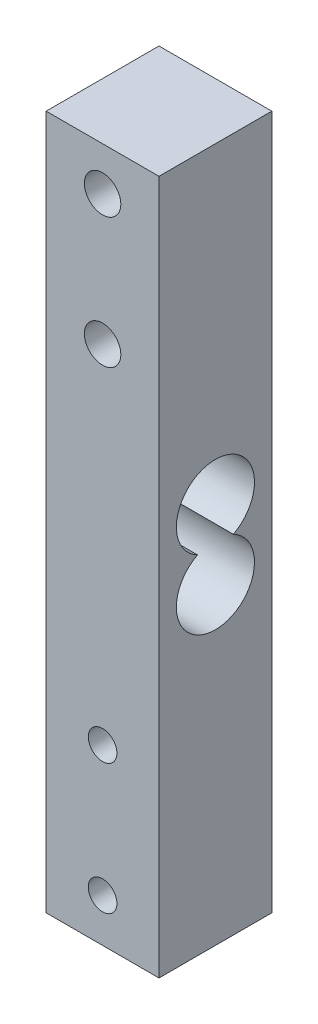
ISO-10303-21;
HEADER;
FILE_DESCRIPTION(('STEP AP214'),'2;1');
FILE_NAME('part.step','',(''),(''),'','','');
FILE_SCHEMA(('AUTOMOTIVE_DESIGN { 1 0 10303 214 1 1 1 1 }'));
ENDSEC;
DATA;
#1=APPLICATION_CONTEXT('core data for automotive mechanical design processes');
#2=APPLICATION_PROTOCOL_DEFINITION('international standard','automotive_design',2000,#1);
#3=PRODUCT_CONTEXT('',#1,'mechanical');
#4=PRODUCT('Part','Part','',(#3));
#5=PRODUCT_RELATED_PRODUCT_CATEGORY('part','',(#4));
#6=PRODUCT_DEFINITION_FORMATION('','',#4);
#7=PRODUCT_DEFINITION_CONTEXT('part definition',#1,'design');
#8=PRODUCT_DEFINITION('design','',#6,#7);
#9=PRODUCT_DEFINITION_SHAPE('','',#8);
#10=(LENGTH_UNIT() NAMED_UNIT(*) SI_UNIT(.MILLI.,.METRE.));
#11=(NAMED_UNIT(*) PLANE_ANGLE_UNIT() SI_UNIT($,.RADIAN.));
#12=(NAMED_UNIT(*) SI_UNIT($,.STERADIAN.) SOLID_ANGLE_UNIT());
#13=UNCERTAINTY_MEASURE_WITH_UNIT(LENGTH_MEASURE(1.E-05),#10,'distance_accuracy_value','');
#14=(GEOMETRIC_REPRESENTATION_CONTEXT(3) GLOBAL_UNCERTAINTY_ASSIGNED_CONTEXT((#13)) GLOBAL_UNIT_ASSIGNED_CONTEXT((#10,
#11,#12)) REPRESENTATION_CONTEXT('',''));
#15=CARTESIAN_POINT('',(0.,0.,0.));
#16=DIRECTION('',(0.,0.,1.));
#17=DIRECTION('',(1.,0.,0.));
#18=AXIS2_PLACEMENT_3D('',#15,#16,#17);
#19=CARTESIAN_POINT('',(0.,0.,13.));
#20=DIRECTION('',(0.,0.,1.));
#21=DIRECTION('',(1.,0.,0.));
#22=AXIS2_PLACEMENT_3D('',#19,#20,#21);
#23=PLANE('',#22);
#24=CARTESIAN_POINT('',(0.560222303890406,-60.7047101449275,13.));
#25=DIRECTION('',(0.,0.,1.));
#26=DIRECTION('',(1.,0.,0.));
#27=AXIS2_PLACEMENT_3D('',#24,#25,#26);
#28=CIRCLE('',#27,1.65);
#29=CARTESIAN_POINT('',(2.21022230389041,-60.7047101449275,13.));
#30=VERTEX_POINT('',#29);
#31=EDGE_CURVE('E251',#30,#30,#28,.T.);
#32=ORIENTED_EDGE('',*,*,#31,.F.);
#33=EDGE_LOOP('',(#32));
#34=FACE_BOUND('',#33,.T.);
#35=CARTESIAN_POINT('',(0.560222303890406,9.29528985507247,13.));
#36=DIRECTION('',(0.,0.,1.));
#37=DIRECTION('',(1.,0.,0.));
#38=AXIS2_PLACEMENT_3D('',#35,#36,#37);
#39=CIRCLE('',#38,2.1);
#40=CARTESIAN_POINT('',(2.66022230389041,9.29528985507247,13.));
#41=VERTEX_POINT('',#40);
#42=EDGE_CURVE('E267',#41,#41,#39,.T.);
#43=ORIENTED_EDGE('',*,*,#42,.F.);
#44=EDGE_LOOP('',(#43));
#45=FACE_BOUND('',#44,.T.);
#46=DIRECTION('',(0.,-1.,0.));
#47=VECTOR('',#46,1.);
#48=CARTESIAN_POINT('',(-5.9397776961096,14.2952898550725,13.));
#49=LINE('',#48,#47);
#50=CARTESIAN_POINT('',(-5.9397776961096,14.2952898550725,13.));
#51=VERTEX_POINT('',#50);
#52=CARTESIAN_POINT('',(-5.93977769610959,-65.7047101449275,13.));
#53=VERTEX_POINT('',#52);
#54=EDGE_CURVE('E275',#51,#53,#49,.T.);
#55=ORIENTED_EDGE('',*,*,#54,.T.);
#56=DIRECTION('',(1.,0.,0.));
#57=VECTOR('',#56,1.);
#58=CARTESIAN_POINT('',(-5.93977769610959,-65.7047101449275,13.));
#59=LINE('',#58,#57);
#60=CARTESIAN_POINT('',(7.06022230389041,-65.7047101449275,13.));
#61=VERTEX_POINT('',#60);
#62=EDGE_CURVE('E279',#53,#61,#59,.T.);
#63=ORIENTED_EDGE('',*,*,#62,.T.);
#64=DIRECTION('',(0.,1.,0.));
#65=VECTOR('',#64,1.);
#66=CARTESIAN_POINT('',(7.0602223038904,14.2952898550725,13.));
#67=LINE('',#66,#65);
#68=CARTESIAN_POINT('',(7.0602223038904,14.2952898550725,13.));
#69=VERTEX_POINT('',#68);
#70=EDGE_CURVE('E283',#61,#69,#67,.T.);
#71=ORIENTED_EDGE('',*,*,#70,.T.);
#72=DIRECTION('',(-1.,0.,0.));
#73=VECTOR('',#72,1.);
#74=CARTESIAN_POINT('',(-5.9397776961096,14.2952898550725,13.));
#75=LINE('',#74,#73);
#76=EDGE_CURVE('E286',#69,#51,#75,.T.);
#77=ORIENTED_EDGE('',*,*,#76,.T.);
#78=EDGE_LOOP('',(#55,#63,#71,#77));
#79=FACE_BOUND('',#78,.T.);
#80=CARTESIAN_POINT('',(0.560222303890406,-5.70471014492753,13.));
#81=DIRECTION('',(0.,0.,1.));
#82=DIRECTION('',(1.,0.,0.));
#83=AXIS2_PLACEMENT_3D('',#80,#81,#82);
#84=CIRCLE('',#83,2.1);
#85=CARTESIAN_POINT('',(2.66022230389041,-5.70471014492753,13.));
#86=VERTEX_POINT('',#85);
#87=EDGE_CURVE('E259',#86,#86,#84,.T.);
#88=ORIENTED_EDGE('',*,*,#87,.F.);
#89=EDGE_LOOP('',(#88));
#90=FACE_BOUND('',#89,.T.);
#91=CARTESIAN_POINT('',(0.560222303890406,-45.7047101449275,13.));
#92=DIRECTION('',(0.,0.,1.));
#93=DIRECTION('',(1.,0.,0.));
#94=AXIS2_PLACEMENT_3D('',#91,#92,#93);
#95=CIRCLE('',#94,1.65);
#96=CARTESIAN_POINT('',(2.21022230389041,-45.7047101449275,13.));
#97=VERTEX_POINT('',#96);
#98=EDGE_CURVE('E243',#97,#97,#95,.T.);
#99=ORIENTED_EDGE('',*,*,#98,.F.);
#100=EDGE_LOOP('',(#99));
#101=FACE_BOUND('',#100,.T.);
#102=ADVANCED_FACE('F43',(#34,#45,#79,#90,#101),#23,.T.);
#103=CARTESIAN_POINT('',(0.,0.,0.));
#104=DIRECTION('',(0.,0.,1.));
#105=DIRECTION('',(1.,0.,0.));
#106=AXIS2_PLACEMENT_3D('',#103,#104,#105);
#107=PLANE('',#106);
#108=DIRECTION('',(0.,-1.,0.));
#109=VECTOR('',#108,1.);
#110=CARTESIAN_POINT('',(-5.9397776961096,14.2952898550725,0.));
#111=LINE('',#110,#109);
#112=CARTESIAN_POINT('',(-5.9397776961096,14.2952898550725,0.));
#113=VERTEX_POINT('',#112);
#114=CARTESIAN_POINT('',(-5.93977769610959,-65.7047101449275,0.));
#115=VERTEX_POINT('',#114);
#116=EDGE_CURVE('E271',#113,#115,#111,.T.);
#117=ORIENTED_EDGE('',*,*,#116,.F.);
#118=DIRECTION('',(-1.,0.,0.));
#119=VECTOR('',#118,1.);
#120=CARTESIAN_POINT('',(-5.9397776961096,14.2952898550725,0.));
#121=LINE('',#120,#119);
#122=CARTESIAN_POINT('',(7.0602223038904,14.2952898550725,0.));
#123=VERTEX_POINT('',#122);
#124=EDGE_CURVE('E280',#123,#113,#121,.T.);
#125=ORIENTED_EDGE('',*,*,#124,.F.);
#126=DIRECTION('',(0.,1.,0.));
#127=VECTOR('',#126,1.);
#128=CARTESIAN_POINT('',(7.0602223038904,14.2952898550725,0.));
#129=LINE('',#128,#127);
#130=CARTESIAN_POINT('',(7.06022230389041,-65.7047101449275,0.));
#131=VERTEX_POINT('',#130);
#132=EDGE_CURVE('E296',#131,#123,#129,.T.);
#133=ORIENTED_EDGE('',*,*,#132,.F.);
#134=DIRECTION('',(1.,0.,0.));
#135=VECTOR('',#134,1.);
#136=CARTESIAN_POINT('',(-5.93977769610959,-65.7047101449275,0.));
#137=LINE('',#136,#135);
#138=EDGE_CURVE('E293',#115,#131,#137,.T.);
#139=ORIENTED_EDGE('',*,*,#138,.F.);
#140=EDGE_LOOP('',(#117,#125,#133,#139));
#141=FACE_BOUND('',#140,.T.);
#142=CARTESIAN_POINT('',(0.560222303890406,9.29528985507247,0.));
#143=DIRECTION('',(0.,0.,1.));
#144=DIRECTION('',(1.,0.,0.));
#145=AXIS2_PLACEMENT_3D('',#142,#143,#144);
#146=CIRCLE('',#145,2.1);
#147=CARTESIAN_POINT('',(2.66022230389041,9.29528985507247,0.));
#148=VERTEX_POINT('',#147);
#149=EDGE_CURVE('E263',#148,#148,#146,.T.);
#150=ORIENTED_EDGE('',*,*,#149,.T.);
#151=EDGE_LOOP('',(#150));
#152=FACE_BOUND('',#151,.T.);
#153=CARTESIAN_POINT('',(0.560222303890406,-5.70471014492753,0.));
#154=DIRECTION('',(0.,0.,1.));
#155=DIRECTION('',(1.,0.,0.));
#156=AXIS2_PLACEMENT_3D('',#153,#154,#155);
#157=CIRCLE('',#156,2.1);
#158=CARTESIAN_POINT('',(2.66022230389041,-5.70471014492753,0.));
#159=VERTEX_POINT('',#158);
#160=EDGE_CURVE('E255',#159,#159,#157,.T.);
#161=ORIENTED_EDGE('',*,*,#160,.T.);
#162=EDGE_LOOP('',(#161));
#163=FACE_BOUND('',#162,.T.);
#164=CARTESIAN_POINT('',(0.560222303890406,-60.7047101449275,0.));
#165=DIRECTION('',(0.,0.,1.));
#166=DIRECTION('',(1.,0.,0.));
#167=AXIS2_PLACEMENT_3D('',#164,#165,#166);
#168=CIRCLE('',#167,1.65);
#169=CARTESIAN_POINT('',(2.21022230389041,-60.7047101449275,0.));
#170=VERTEX_POINT('',#169);
#171=EDGE_CURVE('E247',#170,#170,#168,.T.);
#172=ORIENTED_EDGE('',*,*,#171,.T.);
#173=EDGE_LOOP('',(#172));
#174=FACE_BOUND('',#173,.T.);
#175=CARTESIAN_POINT('',(0.560222303890406,-45.7047101449275,0.));
#176=DIRECTION('',(0.,0.,1.));
#177=DIRECTION('',(1.,0.,0.));
#178=AXIS2_PLACEMENT_3D('',#175,#176,#177);
#179=CIRCLE('',#178,1.65);
#180=CARTESIAN_POINT('',(2.21022230389041,-45.7047101449275,0.));
#181=VERTEX_POINT('',#180);
#182=EDGE_CURVE('E239',#181,#181,#179,.T.);
#183=ORIENTED_EDGE('',*,*,#182,.T.);
#184=EDGE_LOOP('',(#183));
#185=FACE_BOUND('',#184,.T.);
#186=ADVANCED_FACE('F319',(#141,#152,#163,#174,#185),#107,.F.);
#187=CARTESIAN_POINT('',(-5.9397776961096,14.2952898550725,13.));
#188=DIRECTION('',(1.,0.,0.));
#189=DIRECTION('',(0.,1.,0.));
#190=AXIS2_PLACEMENT_3D('',#187,#188,#189);
#191=PLANE('',#190);
#192=CARTESIAN_POINT('',(-5.93977769610959,-21.7047101449275,6.5));
#193=DIRECTION('',(1.,0.,0.));
#194=DIRECTION('',(0.,1.,0.));
#195=AXIS2_PLACEMENT_3D('',#192,#193,#194);
#196=CIRCLE('',#195,4.5);
#197=CARTESIAN_POINT('',(-5.93977769610959,-25.7047101449275,4.43844718719118));
#198=VERTEX_POINT('',#197);
#199=CARTESIAN_POINT('',(-5.93977769610959,-25.7047101449275,8.56155281280882));
#200=VERTEX_POINT('',#199);
#201=EDGE_CURVE('E225',#198,#200,#196,.T.);
#202=ORIENTED_EDGE('',*,*,#201,.T.);
#203=CARTESIAN_POINT('',(-5.93977769610959,-29.7047101449275,6.5));
#204=DIRECTION('',(1.,0.,0.));
#205=DIRECTION('',(0.,1.,0.));
#206=AXIS2_PLACEMENT_3D('',#203,#204,#205);
#207=CIRCLE('',#206,4.5);
#208=EDGE_CURVE('E67',#200,#198,#207,.T.);
#209=ORIENTED_EDGE('',*,*,#208,.T.);
#210=EDGE_LOOP('',(#202,#209));
#211=FACE_BOUND('',#210,.T.);
#212=ORIENTED_EDGE('',*,*,#116,.T.);
#213=DIRECTION('',(0.,0.,-1.));
#214=VECTOR('',#213,1.);
#215=CARTESIAN_POINT('',(-5.93977769610959,-65.7047101449275,13.));
#216=LINE('',#215,#214);
#217=EDGE_CURVE('E11',#53,#115,#216,.T.);
#218=ORIENTED_EDGE('',*,*,#217,.F.);
#219=ORIENTED_EDGE('',*,*,#54,.F.);
#220=DIRECTION('',(0.,0.,-1.));
#221=VECTOR('',#220,1.);
#222=CARTESIAN_POINT('',(-5.9397776961096,14.2952898550725,13.));
#223=LINE('',#222,#221);
#224=EDGE_CURVE('E289',#51,#113,#223,.T.);
#225=ORIENTED_EDGE('',*,*,#224,.T.);
#226=EDGE_LOOP('',(#212,#218,#219,#225));
#227=FACE_BOUND('',#226,.T.);
#228=ADVANCED_FACE('F45',(#211,#227),#191,.F.);
#229=CARTESIAN_POINT('',(-5.93977769610959,-65.7047101449275,13.));
#230=DIRECTION('',(0.,1.,0.));
#231=DIRECTION('',(0.,0.,1.));
#232=AXIS2_PLACEMENT_3D('',#229,#230,#231);
#233=PLANE('',#232);
#234=DIRECTION('',(-0.643380344373381,0.,-0.765546688631066));
#235=VECTOR('',#234,1.);
#236=CARTESIAN_POINT('',(0.,-65.7047101449275,10.3807556209639));
#237=LINE('',#236,#235);
#238=CARTESIAN_POINT('',(0.,-65.7047101449275,10.3807556209639));
#239=VERTEX_POINT('',#238);
#240=CARTESIAN_POINT('',(-2.76507441631424,-65.7047101449275,7.09064335418411));
#241=VERTEX_POINT('',#240);
#242=EDGE_CURVE('E187',#239,#241,#237,.T.);
#243=ORIENTED_EDGE('',*,*,#242,.F.);
#244=DIRECTION('',(-0.664465823285282,0.,0.747318653377402));
#245=VECTOR('',#244,1.);
#246=CARTESIAN_POINT('',(0.,-65.7047101449275,10.3807556209639));
#247=LINE('',#246,#245);
#248=CARTESIAN_POINT('',(2.9253480375028,-65.7047101449275,7.09064335418411));
#249=VERTEX_POINT('',#248);
#250=EDGE_CURVE('E59',#249,#239,#247,.T.);
#251=ORIENTED_EDGE('',*,*,#250,.F.);
#252=DIRECTION('',(1.,0.,0.));
#253=VECTOR('',#252,1.);
#254=CARTESIAN_POINT('',(0.797500809807429,-65.7047101449275,7.09064335418411));
#255=LINE('',#254,#253);
#256=CARTESIAN_POINT('',(0.797500809807429,-65.7047101449275,7.09064335418411));
#257=VERTEX_POINT('',#256);
#258=EDGE_CURVE('E163',#257,#249,#255,.T.);
#259=ORIENTED_EDGE('',*,*,#258,.F.);
#260=DIRECTION('',(0.,0.,1.));
#261=VECTOR('',#260,1.);
#262=CARTESIAN_POINT('',(0.797500809807429,-65.7047101449275,1.38173505383554));
#263=LINE('',#262,#261);
#264=CARTESIAN_POINT('',(0.797500809807429,-65.7047101449275,1.38173505383554));
#265=VERTEX_POINT('',#264);
#266=EDGE_CURVE('E167',#265,#257,#263,.T.);
#267=ORIENTED_EDGE('',*,*,#266,.F.);
#268=DIRECTION('',(1.,0.,0.));
#269=VECTOR('',#268,1.);
#270=CARTESIAN_POINT('',(-0.798384610964098,-65.7047101449275,1.38173505383554));
#271=LINE('',#270,#269);
#272=CARTESIAN_POINT('',(-0.798384610964098,-65.7047101449275,1.38173505383554));
#273=VERTEX_POINT('',#272);
#274=EDGE_CURVE('E198',#273,#265,#271,.T.);
#275=ORIENTED_EDGE('',*,*,#274,.F.);
#276=DIRECTION('',(0.,0.,-1.));
#277=VECTOR('',#276,1.);
#278=CARTESIAN_POINT('',(-0.798384610964098,-65.7047101449275,7.09064335418411));
#279=LINE('',#278,#277);
#280=CARTESIAN_POINT('',(-0.798384610964098,-65.7047101449275,7.09064335418411));
#281=VERTEX_POINT('',#280);
#282=EDGE_CURVE('E194',#281,#273,#279,.T.);
#283=ORIENTED_EDGE('',*,*,#282,.F.);
#284=DIRECTION('',(1.,0.,0.));
#285=VECTOR('',#284,1.);
#286=CARTESIAN_POINT('',(-2.76507441631424,-65.7047101449275,7.09064335418411));
#287=LINE('',#286,#285);
#288=EDGE_CURVE('E190',#241,#281,#287,.T.);
#289=ORIENTED_EDGE('',*,*,#288,.F.);
#290=EDGE_LOOP('',(#243,#251,#259,#267,#275,#283,#289));
#291=FACE_BOUND('',#290,.T.);
#292=ORIENTED_EDGE('',*,*,#138,.T.);
#293=DIRECTION('',(0.,0.,-1.));
#294=VECTOR('',#293,1.);
#295=CARTESIAN_POINT('',(7.06022230389041,-65.7047101449275,13.));
#296=LINE('',#295,#294);
#297=EDGE_CURVE('E52',#61,#131,#296,.T.);
#298=ORIENTED_EDGE('',*,*,#297,.F.);
#299=ORIENTED_EDGE('',*,*,#62,.F.);
#300=ORIENTED_EDGE('',*,*,#217,.T.);
#301=EDGE_LOOP('',(#292,#298,#299,#300));
#302=FACE_BOUND('',#301,.T.);
#303=ADVANCED_FACE('F330',(#291,#302),#233,.F.);
#304=CARTESIAN_POINT('',(7.0602223038904,14.2952898550725,13.));
#305=DIRECTION('',(-1.,0.,0.));
#306=DIRECTION('',(0.,-1.,0.));
#307=AXIS2_PLACEMENT_3D('',#304,#305,#306);
#308=PLANE('',#307);
#309=CARTESIAN_POINT('',(7.06022230389041,-21.7047101449275,6.5));
#310=DIRECTION('',(1.,0.,0.));
#311=DIRECTION('',(0.,1.,0.));
#312=AXIS2_PLACEMENT_3D('',#309,#310,#311);
#313=CIRCLE('',#312,4.5);
#314=CARTESIAN_POINT('',(7.06022230389041,-25.7047101449275,4.43844718719118));
#315=VERTEX_POINT('',#314);
#316=CARTESIAN_POINT('',(7.06022230389041,-25.7047101449275,8.56155281280882));
#317=VERTEX_POINT('',#316);
#318=EDGE_CURVE('E226',#315,#317,#313,.T.);
#319=ORIENTED_EDGE('',*,*,#318,.F.);
#320=CARTESIAN_POINT('',(7.06022230389041,-29.7047101449275,6.5));
#321=DIRECTION('',(1.,0.,0.));
#322=DIRECTION('',(0.,1.,0.));
#323=AXIS2_PLACEMENT_3D('',#320,#321,#322);
#324=CIRCLE('',#323,4.5);
#325=EDGE_CURVE('E208',#317,#315,#324,.T.);
#326=ORIENTED_EDGE('',*,*,#325,.F.);
#327=EDGE_LOOP('',(#319,#326));
#328=FACE_BOUND('',#327,.T.);
#329=ORIENTED_EDGE('',*,*,#132,.T.);
#330=DIRECTION('',(0.,0.,-1.));
#331=VECTOR('',#330,1.);
#332=CARTESIAN_POINT('',(7.0602223038904,14.2952898550725,13.));
#333=LINE('',#332,#331);
#334=EDGE_CURVE('E304',#69,#123,#333,.T.);
#335=ORIENTED_EDGE('',*,*,#334,.F.);
#336=ORIENTED_EDGE('',*,*,#70,.F.);
#337=ORIENTED_EDGE('',*,*,#297,.T.);
#338=EDGE_LOOP('',(#329,#335,#336,#337));
#339=FACE_BOUND('',#338,.T.);
#340=ADVANCED_FACE('F313',(#328,#339),#308,.F.);
#341=CARTESIAN_POINT('',(-5.9397776961096,14.2952898550725,13.));
#342=DIRECTION('',(0.,-1.,0.));
#343=DIRECTION('',(0.,0.,-1.));
#344=AXIS2_PLACEMENT_3D('',#341,#342,#343);
#345=PLANE('',#344);
#346=ORIENTED_EDGE('',*,*,#124,.T.);
#347=ORIENTED_EDGE('',*,*,#224,.F.);
#348=ORIENTED_EDGE('',*,*,#76,.F.);
#349=ORIENTED_EDGE('',*,*,#334,.T.);
#350=EDGE_LOOP('',(#346,#347,#348,#349));
#351=FACE_BOUND('',#350,.T.);
#352=ADVANCED_FACE('F323',(#351),#345,.F.);
#353=CARTESIAN_POINT('',(0.560222303890406,9.29528985507247,13.));
#354=DIRECTION('',(0.,0.,-1.));
#355=DIRECTION('',(-1.,0.,0.));
#356=AXIS2_PLACEMENT_3D('',#353,#354,#355);
#357=CYLINDRICAL_SURFACE('',#356,2.1);
#358=ORIENTED_EDGE('',*,*,#42,.T.);
#359=EDGE_LOOP('',(#358));
#360=FACE_BOUND('',#359,.T.);
#361=ORIENTED_EDGE('',*,*,#149,.F.);
#362=EDGE_LOOP('',(#361));
#363=FACE_BOUND('',#362,.T.);
#364=ADVANCED_FACE('F350',(#360,#363),#357,.F.);
#365=CARTESIAN_POINT('',(0.560222303890406,-5.70471014492753,13.));
#366=DIRECTION('',(0.,0.,-1.));
#367=DIRECTION('',(-1.,0.,0.));
#368=AXIS2_PLACEMENT_3D('',#365,#366,#367);
#369=CYLINDRICAL_SURFACE('',#368,2.1);
#370=ORIENTED_EDGE('',*,*,#87,.T.);
#371=EDGE_LOOP('',(#370));
#372=FACE_BOUND('',#371,.T.);
#373=ORIENTED_EDGE('',*,*,#160,.F.);
#374=EDGE_LOOP('',(#373));
#375=FACE_BOUND('',#374,.T.);
#376=ADVANCED_FACE('F357',(#372,#375),#369,.F.);
#377=CARTESIAN_POINT('',(0.560222303890406,-60.7047101449275,13.));
#378=DIRECTION('',(0.,0.,-1.));
#379=DIRECTION('',(-1.,0.,0.));
#380=AXIS2_PLACEMENT_3D('',#377,#378,#379);
#381=CYLINDRICAL_SURFACE('',#380,1.65);
#382=ORIENTED_EDGE('',*,*,#31,.T.);
#383=EDGE_LOOP('',(#382));
#384=FACE_BOUND('',#383,.T.);
#385=ORIENTED_EDGE('',*,*,#171,.F.);
#386=EDGE_LOOP('',(#385));
#387=FACE_BOUND('',#386,.T.);
#388=ADVANCED_FACE('F362',(#384,#387),#381,.F.);
#389=CARTESIAN_POINT('',(0.560222303890406,-45.7047101449275,13.));
#390=DIRECTION('',(0.,0.,-1.));
#391=DIRECTION('',(-1.,0.,0.));
#392=AXIS2_PLACEMENT_3D('',#389,#390,#391);
#393=CYLINDRICAL_SURFACE('',#392,1.65);
#394=ORIENTED_EDGE('',*,*,#98,.T.);
#395=EDGE_LOOP('',(#394));
#396=FACE_BOUND('',#395,.T.);
#397=ORIENTED_EDGE('',*,*,#182,.F.);
#398=EDGE_LOOP('',(#397));
#399=FACE_BOUND('',#398,.T.);
#400=ADVANCED_FACE('F374',(#396,#399),#393,.F.);
#401=CARTESIAN_POINT('',(-5.93977769610959,-29.7047101449275,6.5));
#402=DIRECTION('',(1.,0.,0.));
#403=DIRECTION('',(0.,1.,0.));
#404=AXIS2_PLACEMENT_3D('',#401,#402,#403);
#405=CYLINDRICAL_SURFACE('',#404,4.5);
#406=ORIENTED_EDGE('',*,*,#325,.T.);
#407=DIRECTION('',(1.,0.,0.));
#408=VECTOR('',#407,1.);
#409=CARTESIAN_POINT('',(-5.93977769610959,-25.7047101449275,4.43844718719118));
#410=LINE('',#409,#408);
#411=EDGE_CURVE('E230',#198,#315,#410,.T.);
#412=ORIENTED_EDGE('',*,*,#411,.F.);
#413=ORIENTED_EDGE('',*,*,#208,.F.);
#414=DIRECTION('',(1.,0.,0.));
#415=VECTOR('',#414,1.);
#416=CARTESIAN_POINT('',(-5.93977769610959,-25.7047101449275,8.56155281280882));
#417=LINE('',#416,#415);
#418=EDGE_CURVE('E236',#200,#317,#417,.T.);
#419=ORIENTED_EDGE('',*,*,#418,.T.);
#420=EDGE_LOOP('',(#406,#412,#413,#419));
#421=FACE_BOUND('',#420,.T.);
#422=ADVANCED_FACE('F376',(#421),#405,.F.);
#423=CARTESIAN_POINT('',(-5.93977769610959,-21.7047101449275,6.5));
#424=DIRECTION('',(1.,0.,0.));
#425=DIRECTION('',(0.,1.,0.));
#426=AXIS2_PLACEMENT_3D('',#423,#424,#425);
#427=CYLINDRICAL_SURFACE('',#426,4.5);
#428=ORIENTED_EDGE('',*,*,#318,.T.);
#429=ORIENTED_EDGE('',*,*,#418,.F.);
#430=ORIENTED_EDGE('',*,*,#201,.F.);
#431=ORIENTED_EDGE('',*,*,#411,.T.);
#432=EDGE_LOOP('',(#428,#429,#430,#431));
#433=FACE_BOUND('',#432,.T.);
#434=ADVANCED_FACE('F383',(#433),#427,.F.);
#435=CARTESIAN_POINT('',(0.,-62.7047101449275,10.3807556209639));
#436=DIRECTION('',(0.747318653377401,0.,0.664465823285281));
#437=DIRECTION('',(0.664465823285282,0.,-0.747318653377402));
#438=AXIS2_PLACEMENT_3D('',#435,#436,#437);
#439=PLANE('',#438);
#440=ORIENTED_EDGE('',*,*,#250,.T.);
#441=DIRECTION('',(0.,-1.,0.));
#442=VECTOR('',#441,1.);
#443=CARTESIAN_POINT('',(0.,-62.7047101449275,10.3807556209639));
#444=LINE('',#443,#442);
#445=CARTESIAN_POINT('',(0.,-62.7047101449275,10.3807556209639));
#446=VERTEX_POINT('',#445);
#447=EDGE_CURVE('E137',#446,#239,#444,.T.);
#448=ORIENTED_EDGE('',*,*,#447,.F.);
#449=DIRECTION('',(-0.664465823285282,0.,0.747318653377402));
#450=VECTOR('',#449,1.);
#451=CARTESIAN_POINT('',(0.,-62.7047101449275,10.3807556209639));
#452=LINE('',#451,#450);
#453=CARTESIAN_POINT('',(2.9253480375028,-62.7047101449275,7.09064335418411));
#454=VERTEX_POINT('',#453);
#455=EDGE_CURVE('E141',#454,#446,#452,.T.);
#456=ORIENTED_EDGE('',*,*,#455,.F.);
#457=DIRECTION('',(0.,-1.,0.));
#458=VECTOR('',#457,1.);
#459=CARTESIAN_POINT('',(2.9253480375028,-62.7047101449275,7.09064335418411));
#460=LINE('',#459,#458);
#461=EDGE_CURVE('E205',#454,#249,#460,.T.);
#462=ORIENTED_EDGE('',*,*,#461,.T.);
#463=EDGE_LOOP('',(#440,#448,#456,#462));
#464=FACE_BOUND('',#463,.T.);
#465=ADVANCED_FACE('F139',(#464),#439,.F.);
#466=CARTESIAN_POINT('',(0.797500809807429,-62.7047101449275,7.09064335418411));
#467=DIRECTION('',(0.,0.,-1.));
#468=DIRECTION('',(-1.,0.,0.));
#469=AXIS2_PLACEMENT_3D('',#466,#467,#468);
#470=PLANE('',#469);
#471=ORIENTED_EDGE('',*,*,#258,.T.);
#472=ORIENTED_EDGE('',*,*,#461,.F.);
#473=DIRECTION('',(1.,0.,0.));
#474=VECTOR('',#473,1.);
#475=CARTESIAN_POINT('',(0.797500809807429,-62.7047101449275,7.09064335418411));
#476=LINE('',#475,#474);
#477=CARTESIAN_POINT('',(0.797500809807429,-62.7047101449275,7.09064335418411));
#478=VERTEX_POINT('',#477);
#479=EDGE_CURVE('E148',#478,#454,#476,.T.);
#480=ORIENTED_EDGE('',*,*,#479,.F.);
#481=DIRECTION('',(0.,-1.,0.));
#482=VECTOR('',#481,1.);
#483=CARTESIAN_POINT('',(0.797500809807429,-62.7047101449275,7.09064335418411));
#484=LINE('',#483,#482);
#485=EDGE_CURVE('E209',#478,#257,#484,.T.);
#486=ORIENTED_EDGE('',*,*,#485,.T.);
#487=EDGE_LOOP('',(#471,#472,#480,#486));
#488=FACE_BOUND('',#487,.T.);
#489=ADVANCED_FACE('F393',(#488),#470,.F.);
#490=CARTESIAN_POINT('',(0.797500809807429,-62.7047101449275,1.38173505383554));
#491=DIRECTION('',(1.,0.,0.));
#492=DIRECTION('',(0.,0.,-1.));
#493=AXIS2_PLACEMENT_3D('',#490,#491,#492);
#494=PLANE('',#493);
#495=ORIENTED_EDGE('',*,*,#266,.T.);
#496=ORIENTED_EDGE('',*,*,#485,.F.);
#497=DIRECTION('',(0.,0.,1.));
#498=VECTOR('',#497,1.);
#499=CARTESIAN_POINT('',(0.797500809807429,-62.7047101449275,1.38173505383554));
#500=LINE('',#499,#498);
#501=CARTESIAN_POINT('',(0.797500809807429,-62.7047101449275,1.38173505383554));
#502=VERTEX_POINT('',#501);
#503=EDGE_CURVE('E180',#502,#478,#500,.T.);
#504=ORIENTED_EDGE('',*,*,#503,.F.);
#505=DIRECTION('',(0.,-1.,0.));
#506=VECTOR('',#505,1.);
#507=CARTESIAN_POINT('',(0.797500809807429,-62.7047101449275,1.38173505383554));
#508=LINE('',#507,#506);
#509=EDGE_CURVE('E212',#502,#265,#508,.T.);
#510=ORIENTED_EDGE('',*,*,#509,.T.);
#511=EDGE_LOOP('',(#495,#496,#504,#510));
#512=FACE_BOUND('',#511,.T.);
#513=ADVANCED_FACE('F407',(#512),#494,.F.);
#514=CARTESIAN_POINT('',(-0.798384610964098,-62.7047101449275,1.38173505383554));
#515=DIRECTION('',(0.,0.,-1.));
#516=DIRECTION('',(-1.,0.,0.));
#517=AXIS2_PLACEMENT_3D('',#514,#515,#516);
#518=PLANE('',#517);
#519=ORIENTED_EDGE('',*,*,#274,.T.);
#520=ORIENTED_EDGE('',*,*,#509,.F.);
#521=DIRECTION('',(1.,0.,0.));
#522=VECTOR('',#521,1.);
#523=CARTESIAN_POINT('',(-0.798384610964098,-62.7047101449275,1.38173505383554));
#524=LINE('',#523,#522);
#525=CARTESIAN_POINT('',(-0.798384610964098,-62.7047101449275,1.38173505383554));
#526=VERTEX_POINT('',#525);
#527=EDGE_CURVE('E176',#526,#502,#524,.T.);
#528=ORIENTED_EDGE('',*,*,#527,.F.);
#529=DIRECTION('',(0.,-1.,0.));
#530=VECTOR('',#529,1.);
#531=CARTESIAN_POINT('',(-0.798384610964098,-62.7047101449275,1.38173505383554));
#532=LINE('',#531,#530);
#533=EDGE_CURVE('E215',#526,#273,#532,.T.);
#534=ORIENTED_EDGE('',*,*,#533,.T.);
#535=EDGE_LOOP('',(#519,#520,#528,#534));
#536=FACE_BOUND('',#535,.T.);
#537=ADVANCED_FACE('F403',(#536),#518,.F.);
#538=CARTESIAN_POINT('',(-0.798384610964098,-62.7047101449275,7.09064335418411));
#539=DIRECTION('',(-1.,0.,0.));
#540=DIRECTION('',(0.,0.,1.));
#541=AXIS2_PLACEMENT_3D('',#538,#539,#540);
#542=PLANE('',#541);
#543=ORIENTED_EDGE('',*,*,#282,.T.);
#544=ORIENTED_EDGE('',*,*,#533,.F.);
#545=DIRECTION('',(0.,0.,-1.));
#546=VECTOR('',#545,1.);
#547=CARTESIAN_POINT('',(-0.798384610964098,-62.7047101449275,7.09064335418411));
#548=LINE('',#547,#546);
#549=CARTESIAN_POINT('',(-0.798384610964098,-62.7047101449275,7.09064335418411));
#550=VERTEX_POINT('',#549);
#551=EDGE_CURVE('E172',#550,#526,#548,.T.);
#552=ORIENTED_EDGE('',*,*,#551,.F.);
#553=DIRECTION('',(0.,-1.,0.));
#554=VECTOR('',#553,1.);
#555=CARTESIAN_POINT('',(-0.798384610964098,-62.7047101449275,7.09064335418411));
#556=LINE('',#555,#554);
#557=EDGE_CURVE('E218',#550,#281,#556,.T.);
#558=ORIENTED_EDGE('',*,*,#557,.T.);
#559=EDGE_LOOP('',(#543,#544,#552,#558));
#560=FACE_BOUND('',#559,.T.);
#561=ADVANCED_FACE('F399',(#560),#542,.F.);
#562=CARTESIAN_POINT('',(-2.76507441631424,-62.7047101449275,7.09064335418411));
#563=DIRECTION('',(0.,0.,-1.));
#564=DIRECTION('',(-1.,0.,0.));
#565=AXIS2_PLACEMENT_3D('',#562,#563,#564);
#566=PLANE('',#565);
#567=ORIENTED_EDGE('',*,*,#288,.T.);
#568=ORIENTED_EDGE('',*,*,#557,.F.);
#569=DIRECTION('',(1.,0.,0.));
#570=VECTOR('',#569,1.);
#571=CARTESIAN_POINT('',(-2.76507441631424,-62.7047101449275,7.09064335418411));
#572=LINE('',#571,#570);
#573=CARTESIAN_POINT('',(-2.76507441631424,-62.7047101449275,7.09064335418411));
#574=VERTEX_POINT('',#573);
#575=EDGE_CURVE('E157',#574,#550,#572,.T.);
#576=ORIENTED_EDGE('',*,*,#575,.F.);
#577=DIRECTION('',(0.,-1.,0.));
#578=VECTOR('',#577,1.);
#579=CARTESIAN_POINT('',(-2.76507441631424,-62.7047101449275,7.09064335418411));
#580=LINE('',#579,#578);
#581=EDGE_CURVE('E147',#574,#241,#580,.T.);
#582=ORIENTED_EDGE('',*,*,#581,.T.);
#583=EDGE_LOOP('',(#567,#568,#576,#582));
#584=FACE_BOUND('',#583,.T.);
#585=ADVANCED_FACE('F396',(#584),#566,.F.);
#586=CARTESIAN_POINT('',(0.,-62.7047101449275,10.3807556209639));
#587=DIRECTION('',(-0.765546688631066,0.,0.643380344373381));
#588=DIRECTION('',(0.643380344373381,0.,0.765546688631066));
#589=AXIS2_PLACEMENT_3D('',#586,#587,#588);
#590=PLANE('',#589);
#591=ORIENTED_EDGE('',*,*,#242,.T.);
#592=ORIENTED_EDGE('',*,*,#581,.F.);
#593=DIRECTION('',(-0.643380344373381,0.,-0.765546688631066));
#594=VECTOR('',#593,1.);
#595=CARTESIAN_POINT('',(0.,-62.7047101449275,10.3807556209639));
#596=LINE('',#595,#594);
#597=EDGE_CURVE('E151',#446,#574,#596,.T.);
#598=ORIENTED_EDGE('',*,*,#597,.F.);
#599=ORIENTED_EDGE('',*,*,#447,.T.);
#600=EDGE_LOOP('',(#591,#592,#598,#599));
#601=FACE_BOUND('',#600,.T.);
#602=ADVANCED_FACE('F152',(#601),#590,.F.);
#603=CARTESIAN_POINT('',(0.,-62.7047101449275,0.));
#604=DIRECTION('',(0.,1.,0.));
#605=DIRECTION('',(0.,0.,1.));
#606=AXIS2_PLACEMENT_3D('',#603,#604,#605);
#607=PLANE('',#606);
#608=ORIENTED_EDGE('',*,*,#455,.T.);
#609=ORIENTED_EDGE('',*,*,#597,.T.);
#610=ORIENTED_EDGE('',*,*,#575,.T.);
#611=ORIENTED_EDGE('',*,*,#551,.T.);
#612=ORIENTED_EDGE('',*,*,#527,.T.);
#613=ORIENTED_EDGE('',*,*,#503,.T.);
#614=ORIENTED_EDGE('',*,*,#479,.T.);
#615=EDGE_LOOP('',(#608,#609,#610,#611,#612,#613,#614));
#616=FACE_BOUND('',#615,.T.);
#617=ADVANCED_FACE('F159',(#616),#607,.F.);
#618=CLOSED_SHELL('',(#102,#186,#228,#303,#340,#352,#364,#376,#388,#400,#422,#434,#465,#489,
#513,#537,#561,#585,#602,#617));
#619=MANIFOLD_SOLID_BREP('B2',#618);
#620=ADVANCED_BREP_SHAPE_REPRESENTATION('',(#18,#619),#14);
#621=SHAPE_DEFINITION_REPRESENTATION(#9,#620);
ENDSEC;
END-ISO-10303-21;
